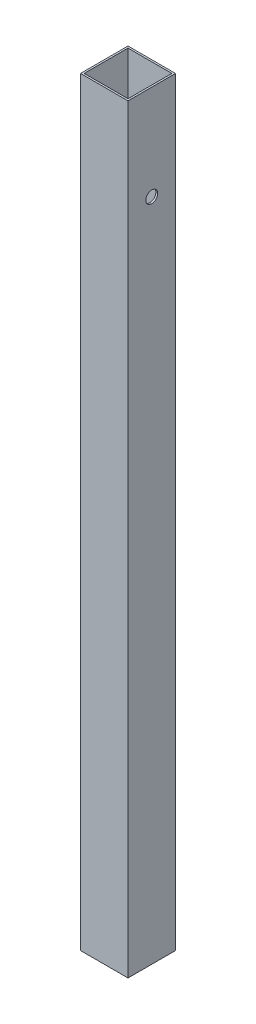
ISO-10303-21;
HEADER;
FILE_DESCRIPTION(('STEP AP214'),'2;1');
FILE_NAME('part.step','',(''),(''),'','','');
FILE_SCHEMA(('AUTOMOTIVE_DESIGN { 1 0 10303 214 1 1 1 1 }'));
ENDSEC;
DATA;
#1=APPLICATION_CONTEXT('core data for automotive mechanical design processes');
#2=APPLICATION_PROTOCOL_DEFINITION('international standard','automotive_design',2000,#1);
#3=PRODUCT_CONTEXT('',#1,'mechanical');
#4=PRODUCT('Part','Part','',(#3));
#5=PRODUCT_RELATED_PRODUCT_CATEGORY('part','',(#4));
#6=PRODUCT_DEFINITION_FORMATION('','',#4);
#7=PRODUCT_DEFINITION_CONTEXT('part definition',#1,'design');
#8=PRODUCT_DEFINITION('design','',#6,#7);
#9=PRODUCT_DEFINITION_SHAPE('','',#8);
#10=(LENGTH_UNIT() NAMED_UNIT(*) SI_UNIT(.MILLI.,.METRE.));
#11=(NAMED_UNIT(*) PLANE_ANGLE_UNIT() SI_UNIT($,.RADIAN.));
#12=(NAMED_UNIT(*) SI_UNIT($,.STERADIAN.) SOLID_ANGLE_UNIT());
#13=UNCERTAINTY_MEASURE_WITH_UNIT(LENGTH_MEASURE(1.E-05),#10,'distance_accuracy_value','');
#14=(GEOMETRIC_REPRESENTATION_CONTEXT(3) GLOBAL_UNCERTAINTY_ASSIGNED_CONTEXT((#13)) GLOBAL_UNIT_ASSIGNED_CONTEXT((#10,
#11,#12)) REPRESENTATION_CONTEXT('',''));
#15=CARTESIAN_POINT('',(0.,0.,0.));
#16=DIRECTION('',(0.,0.,1.));
#17=DIRECTION('',(1.,0.,0.));
#18=AXIS2_PLACEMENT_3D('',#15,#16,#17);
#19=CARTESIAN_POINT('',(0.,406.4,0.));
#20=DIRECTION('',(0.,1.,0.));
#21=DIRECTION('',(0.,0.,1.));
#22=AXIS2_PLACEMENT_3D('',#19,#20,#21);
#23=PLANE('',#22);
#24=DIRECTION('',(0.,0.,-1.));
#25=VECTOR('',#24,1.);
#26=CARTESIAN_POINT('',(12.7,406.4,-12.7));
#27=LINE('',#26,#25);
#28=CARTESIAN_POINT('',(12.7,406.4,12.7));
#29=VERTEX_POINT('',#28);
#30=CARTESIAN_POINT('',(12.7,406.4,-12.7));
#31=VERTEX_POINT('',#30);
#32=EDGE_CURVE('E139',#29,#31,#27,.T.);
#33=ORIENTED_EDGE('',*,*,#32,.T.);
#34=DIRECTION('',(-1.,0.,0.));
#35=VECTOR('',#34,1.);
#36=CARTESIAN_POINT('',(-12.7,406.4,-12.7));
#37=LINE('',#36,#35);
#38=CARTESIAN_POINT('',(-12.7,406.4,-12.7));
#39=VERTEX_POINT('',#38);
#40=EDGE_CURVE('E142',#31,#39,#37,.T.);
#41=ORIENTED_EDGE('',*,*,#40,.T.);
#42=DIRECTION('',(0.,0.,1.));
#43=VECTOR('',#42,1.);
#44=CARTESIAN_POINT('',(-12.7,406.4,-12.7));
#45=LINE('',#44,#43);
#46=CARTESIAN_POINT('',(-12.7,406.4,12.7));
#47=VERTEX_POINT('',#46);
#48=EDGE_CURVE('E145',#39,#47,#45,.T.);
#49=ORIENTED_EDGE('',*,*,#48,.T.);
#50=DIRECTION('',(1.,0.,0.));
#51=VECTOR('',#50,1.);
#52=CARTESIAN_POINT('',(-12.7,406.4,12.7));
#53=LINE('',#52,#51);
#54=EDGE_CURVE('E147',#47,#29,#53,.T.);
#55=ORIENTED_EDGE('',*,*,#54,.T.);
#56=EDGE_LOOP('',(#33,#41,#49,#55));
#57=FACE_BOUND('',#56,.T.);
#58=DIRECTION('',(1.,0.,0.));
#59=VECTOR('',#58,1.);
#60=CARTESIAN_POINT('',(-11.7348,406.4,11.7348));
#61=LINE('',#60,#59);
#62=CARTESIAN_POINT('',(-11.7348,406.4,11.7348));
#63=VERTEX_POINT('',#62);
#64=CARTESIAN_POINT('',(11.7348,406.4,11.7348));
#65=VERTEX_POINT('',#64);
#66=EDGE_CURVE('E109',#63,#65,#61,.T.);
#67=ORIENTED_EDGE('',*,*,#66,.F.);
#68=DIRECTION('',(0.,0.,1.));
#69=VECTOR('',#68,1.);
#70=CARTESIAN_POINT('',(-11.7348,406.4,-11.7348));
#71=LINE('',#70,#69);
#72=CARTESIAN_POINT('',(-11.7348,406.4,-11.7348));
#73=VERTEX_POINT('',#72);
#74=EDGE_CURVE('E101',#73,#63,#71,.T.);
#75=ORIENTED_EDGE('',*,*,#74,.F.);
#76=DIRECTION('',(-1.,0.,0.));
#77=VECTOR('',#76,1.);
#78=CARTESIAN_POINT('',(-11.7348,406.4,-11.7348));
#79=LINE('',#78,#77);
#80=CARTESIAN_POINT('',(11.7348,406.4,-11.7348));
#81=VERTEX_POINT('',#80);
#82=EDGE_CURVE('E123',#81,#73,#79,.T.);
#83=ORIENTED_EDGE('',*,*,#82,.F.);
#84=DIRECTION('',(0.,0.,-1.));
#85=VECTOR('',#84,1.);
#86=CARTESIAN_POINT('',(11.7348,406.4,-11.7348));
#87=LINE('',#86,#85);
#88=EDGE_CURVE('E121',#65,#81,#87,.T.);
#89=ORIENTED_EDGE('',*,*,#88,.F.);
#90=EDGE_LOOP('',(#67,#75,#83,#89));
#91=FACE_BOUND('',#90,.T.);
#92=ADVANCED_FACE('F35',(#57,#91),#23,.T.);
#93=CARTESIAN_POINT('',(0.,0.,0.));
#94=DIRECTION('',(0.,1.,0.));
#95=DIRECTION('',(0.,0.,1.));
#96=AXIS2_PLACEMENT_3D('',#93,#94,#95);
#97=PLANE('',#96);
#98=DIRECTION('',(0.,0.,-1.));
#99=VECTOR('',#98,1.);
#100=CARTESIAN_POINT('',(12.7,0.,-12.7));
#101=LINE('',#100,#99);
#102=CARTESIAN_POINT('',(12.7,0.,12.7));
#103=VERTEX_POINT('',#102);
#104=CARTESIAN_POINT('',(12.7,0.,-12.7));
#105=VERTEX_POINT('',#104);
#106=EDGE_CURVE('E117',#103,#105,#101,.T.);
#107=ORIENTED_EDGE('',*,*,#106,.F.);
#108=DIRECTION('',(1.,0.,0.));
#109=VECTOR('',#108,1.);
#110=CARTESIAN_POINT('',(-12.7,0.,12.7));
#111=LINE('',#110,#109);
#112=CARTESIAN_POINT('',(-12.7,0.,12.7));
#113=VERTEX_POINT('',#112);
#114=EDGE_CURVE('E143',#113,#103,#111,.T.);
#115=ORIENTED_EDGE('',*,*,#114,.F.);
#116=DIRECTION('',(0.,0.,1.));
#117=VECTOR('',#116,1.);
#118=CARTESIAN_POINT('',(-12.7,0.,-12.7));
#119=LINE('',#118,#117);
#120=CARTESIAN_POINT('',(-12.7,0.,-12.7));
#121=VERTEX_POINT('',#120);
#122=EDGE_CURVE('E154',#121,#113,#119,.T.);
#123=ORIENTED_EDGE('',*,*,#122,.F.);
#124=DIRECTION('',(-1.,0.,0.));
#125=VECTOR('',#124,1.);
#126=CARTESIAN_POINT('',(-12.7,0.,-12.7));
#127=LINE('',#126,#125);
#128=EDGE_CURVE('E152',#105,#121,#127,.T.);
#129=ORIENTED_EDGE('',*,*,#128,.F.);
#130=EDGE_LOOP('',(#107,#115,#123,#129));
#131=FACE_BOUND('',#130,.T.);
#132=DIRECTION('',(0.,0.,1.));
#133=VECTOR('',#132,1.);
#134=CARTESIAN_POINT('',(-11.7348,0.,-11.7348));
#135=LINE('',#134,#133);
#136=CARTESIAN_POINT('',(-11.7348,0.,-11.7348));
#137=VERTEX_POINT('',#136);
#138=CARTESIAN_POINT('',(-11.7348,0.,11.7348));
#139=VERTEX_POINT('',#138);
#140=EDGE_CURVE('E59',#137,#139,#135,.T.);
#141=ORIENTED_EDGE('',*,*,#140,.T.);
#142=DIRECTION('',(1.,0.,0.));
#143=VECTOR('',#142,1.);
#144=CARTESIAN_POINT('',(-11.7348,0.,11.7348));
#145=LINE('',#144,#143);
#146=CARTESIAN_POINT('',(11.7348,0.,11.7348));
#147=VERTEX_POINT('',#146);
#148=EDGE_CURVE('E116',#139,#147,#145,.T.);
#149=ORIENTED_EDGE('',*,*,#148,.T.);
#150=DIRECTION('',(0.,0.,-1.));
#151=VECTOR('',#150,1.);
#152=CARTESIAN_POINT('',(11.7348,0.,-11.7348));
#153=LINE('',#152,#151);
#154=CARTESIAN_POINT('',(11.7348,0.,-11.7348));
#155=VERTEX_POINT('',#154);
#156=EDGE_CURVE('E131',#147,#155,#153,.T.);
#157=ORIENTED_EDGE('',*,*,#156,.T.);
#158=DIRECTION('',(-1.,0.,0.));
#159=VECTOR('',#158,1.);
#160=CARTESIAN_POINT('',(-11.7348,0.,-11.7348));
#161=LINE('',#160,#159);
#162=EDGE_CURVE('E110',#155,#137,#161,.T.);
#163=ORIENTED_EDGE('',*,*,#162,.T.);
#164=EDGE_LOOP('',(#141,#149,#157,#163));
#165=FACE_BOUND('',#164,.T.);
#166=ADVANCED_FACE('F173',(#131,#165),#97,.F.);
#167=CARTESIAN_POINT('',(12.7,406.4,-12.7));
#168=DIRECTION('',(-1.,0.,0.));
#169=DIRECTION('',(0.,0.,1.));
#170=AXIS2_PLACEMENT_3D('',#167,#168,#169);
#171=PLANE('',#170);
#172=CARTESIAN_POINT('',(12.7,355.6,0.));
#173=DIRECTION('',(-1.,0.,0.));
#174=DIRECTION('',(0.,0.,1.));
#175=AXIS2_PLACEMENT_3D('',#172,#173,#174);
#176=CIRCLE('',#175,3.175);
#177=CARTESIAN_POINT('',(12.7,355.6,3.175));
#178=VERTEX_POINT('',#177);
#179=EDGE_CURVE('E129',#178,#178,#176,.T.);
#180=ORIENTED_EDGE('',*,*,#179,.T.);
#181=EDGE_LOOP('',(#180));
#182=FACE_BOUND('',#181,.T.);
#183=ORIENTED_EDGE('',*,*,#106,.T.);
#184=DIRECTION('',(0.,-1.,0.));
#185=VECTOR('',#184,1.);
#186=CARTESIAN_POINT('',(12.7,406.4,-12.7));
#187=LINE('',#186,#185);
#188=EDGE_CURVE('E11',#31,#105,#187,.T.);
#189=ORIENTED_EDGE('',*,*,#188,.F.);
#190=ORIENTED_EDGE('',*,*,#32,.F.);
#191=DIRECTION('',(0.,-1.,0.));
#192=VECTOR('',#191,1.);
#193=CARTESIAN_POINT('',(12.7,406.4,12.7));
#194=LINE('',#193,#192);
#195=EDGE_CURVE('E149',#29,#103,#194,.T.);
#196=ORIENTED_EDGE('',*,*,#195,.T.);
#197=EDGE_LOOP('',(#183,#189,#190,#196));
#198=FACE_BOUND('',#197,.T.);
#199=ADVANCED_FACE('F37',(#182,#198),#171,.F.);
#200=CARTESIAN_POINT('',(-12.7,406.4,-12.7));
#201=DIRECTION('',(0.,0.,1.));
#202=DIRECTION('',(1.,0.,0.));
#203=AXIS2_PLACEMENT_3D('',#200,#201,#202);
#204=PLANE('',#203);
#205=ORIENTED_EDGE('',*,*,#128,.T.);
#206=DIRECTION('',(0.,-1.,0.));
#207=VECTOR('',#206,1.);
#208=CARTESIAN_POINT('',(-12.7,406.4,-12.7));
#209=LINE('',#208,#207);
#210=EDGE_CURVE('E44',#39,#121,#209,.T.);
#211=ORIENTED_EDGE('',*,*,#210,.F.);
#212=ORIENTED_EDGE('',*,*,#40,.F.);
#213=ORIENTED_EDGE('',*,*,#188,.T.);
#214=EDGE_LOOP('',(#205,#211,#212,#213));
#215=FACE_BOUND('',#214,.T.);
#216=ADVANCED_FACE('F183',(#215),#204,.F.);
#217=CARTESIAN_POINT('',(-12.7,406.4,-12.7));
#218=DIRECTION('',(1.,0.,0.));
#219=DIRECTION('',(0.,0.,-1.));
#220=AXIS2_PLACEMENT_3D('',#217,#218,#219);
#221=PLANE('',#220);
#222=CARTESIAN_POINT('',(-12.7,355.6,0.));
#223=DIRECTION('',(-1.,0.,0.));
#224=DIRECTION('',(0.,0.,1.));
#225=AXIS2_PLACEMENT_3D('',#222,#223,#224);
#226=CIRCLE('',#225,3.175);
#227=CARTESIAN_POINT('',(-12.7,355.6,3.175));
#228=VERTEX_POINT('',#227);
#229=EDGE_CURVE('E217',#228,#228,#226,.T.);
#230=ORIENTED_EDGE('',*,*,#229,.F.);
#231=EDGE_LOOP('',(#230));
#232=FACE_BOUND('',#231,.T.);
#233=ORIENTED_EDGE('',*,*,#122,.T.);
#234=DIRECTION('',(0.,-1.,0.));
#235=VECTOR('',#234,1.);
#236=CARTESIAN_POINT('',(-12.7,406.4,12.7));
#237=LINE('',#236,#235);
#238=EDGE_CURVE('E159',#47,#113,#237,.T.);
#239=ORIENTED_EDGE('',*,*,#238,.F.);
#240=ORIENTED_EDGE('',*,*,#48,.F.);
#241=ORIENTED_EDGE('',*,*,#210,.T.);
#242=EDGE_LOOP('',(#233,#239,#240,#241));
#243=FACE_BOUND('',#242,.T.);
#244=ADVANCED_FACE('F167',(#232,#243),#221,.F.);
#245=CARTESIAN_POINT('',(-12.7,406.4,12.7));
#246=DIRECTION('',(0.,0.,-1.));
#247=DIRECTION('',(-1.,0.,0.));
#248=AXIS2_PLACEMENT_3D('',#245,#246,#247);
#249=PLANE('',#248);
#250=ORIENTED_EDGE('',*,*,#114,.T.);
#251=ORIENTED_EDGE('',*,*,#195,.F.);
#252=ORIENTED_EDGE('',*,*,#54,.F.);
#253=ORIENTED_EDGE('',*,*,#238,.T.);
#254=EDGE_LOOP('',(#250,#251,#252,#253));
#255=FACE_BOUND('',#254,.T.);
#256=ADVANCED_FACE('F177',(#255),#249,.F.);
#257=CARTESIAN_POINT('',(-11.7348,406.4,-11.7348));
#258=DIRECTION('',(1.,0.,0.));
#259=DIRECTION('',(0.,0.,-1.));
#260=AXIS2_PLACEMENT_3D('',#257,#258,#259);
#261=PLANE('',#260);
#262=CARTESIAN_POINT('',(-11.7348,355.6,0.));
#263=DIRECTION('',(1.,0.,0.));
#264=DIRECTION('',(0.,0.,-1.));
#265=AXIS2_PLACEMENT_3D('',#262,#263,#264);
#266=CIRCLE('',#265,3.175);
#267=CARTESIAN_POINT('',(-11.7348,355.6,-3.175));
#268=VERTEX_POINT('',#267);
#269=EDGE_CURVE('E212',#268,#268,#266,.T.);
#270=ORIENTED_EDGE('',*,*,#269,.F.);
#271=EDGE_LOOP('',(#270));
#272=FACE_BOUND('',#271,.T.);
#273=ORIENTED_EDGE('',*,*,#140,.F.);
#274=DIRECTION('',(0.,-1.,0.));
#275=VECTOR('',#274,1.);
#276=CARTESIAN_POINT('',(-11.7348,406.4,-11.7348));
#277=LINE('',#276,#275);
#278=EDGE_CURVE('E105',#73,#137,#277,.T.);
#279=ORIENTED_EDGE('',*,*,#278,.F.);
#280=ORIENTED_EDGE('',*,*,#74,.T.);
#281=DIRECTION('',(0.,-1.,0.));
#282=VECTOR('',#281,1.);
#283=CARTESIAN_POINT('',(-11.7348,406.4,11.7348));
#284=LINE('',#283,#282);
#285=EDGE_CURVE('E104',#63,#139,#284,.T.);
#286=ORIENTED_EDGE('',*,*,#285,.T.);
#287=EDGE_LOOP('',(#273,#279,#280,#286));
#288=FACE_BOUND('',#287,.T.);
#289=ADVANCED_FACE('F103',(#272,#288),#261,.T.);
#290=CARTESIAN_POINT('',(-11.7348,406.4,11.7348));
#291=DIRECTION('',(0.,0.,-1.));
#292=DIRECTION('',(-1.,0.,0.));
#293=AXIS2_PLACEMENT_3D('',#290,#291,#292);
#294=PLANE('',#293);
#295=ORIENTED_EDGE('',*,*,#148,.F.);
#296=ORIENTED_EDGE('',*,*,#285,.F.);
#297=ORIENTED_EDGE('',*,*,#66,.T.);
#298=DIRECTION('',(0.,-1.,0.));
#299=VECTOR('',#298,1.);
#300=CARTESIAN_POINT('',(11.7348,406.4,11.7348));
#301=LINE('',#300,#299);
#302=EDGE_CURVE('E118',#65,#147,#301,.T.);
#303=ORIENTED_EDGE('',*,*,#302,.T.);
#304=EDGE_LOOP('',(#295,#296,#297,#303));
#305=FACE_BOUND('',#304,.T.);
#306=ADVANCED_FACE('F113',(#305),#294,.T.);
#307=CARTESIAN_POINT('',(11.7348,406.4,-11.7348));
#308=DIRECTION('',(-1.,0.,0.));
#309=DIRECTION('',(0.,0.,1.));
#310=AXIS2_PLACEMENT_3D('',#307,#308,#309);
#311=PLANE('',#310);
#312=CARTESIAN_POINT('',(11.7348,355.6,0.));
#313=DIRECTION('',(-1.,0.,0.));
#314=DIRECTION('',(0.,0.,1.));
#315=AXIS2_PLACEMENT_3D('',#312,#313,#314);
#316=CIRCLE('',#315,3.175);
#317=CARTESIAN_POINT('',(11.7348,355.6,3.175));
#318=VERTEX_POINT('',#317);
#319=EDGE_CURVE('E39',#318,#318,#316,.T.);
#320=ORIENTED_EDGE('',*,*,#319,.F.);
#321=EDGE_LOOP('',(#320));
#322=FACE_BOUND('',#321,.T.);
#323=ORIENTED_EDGE('',*,*,#156,.F.);
#324=ORIENTED_EDGE('',*,*,#302,.F.);
#325=ORIENTED_EDGE('',*,*,#88,.T.);
#326=DIRECTION('',(0.,-1.,0.));
#327=VECTOR('',#326,1.);
#328=CARTESIAN_POINT('',(11.7348,406.4,-11.7348));
#329=LINE('',#328,#327);
#330=EDGE_CURVE('E51',#81,#155,#329,.T.);
#331=ORIENTED_EDGE('',*,*,#330,.T.);
#332=EDGE_LOOP('',(#323,#324,#325,#331));
#333=FACE_BOUND('',#332,.T.);
#334=ADVANCED_FACE('F209',(#322,#333),#311,.T.);
#335=CARTESIAN_POINT('',(-11.7348,406.4,-11.7348));
#336=DIRECTION('',(0.,0.,1.));
#337=DIRECTION('',(1.,0.,0.));
#338=AXIS2_PLACEMENT_3D('',#335,#336,#337);
#339=PLANE('',#338);
#340=ORIENTED_EDGE('',*,*,#162,.F.);
#341=ORIENTED_EDGE('',*,*,#330,.F.);
#342=ORIENTED_EDGE('',*,*,#82,.T.);
#343=ORIENTED_EDGE('',*,*,#278,.T.);
#344=EDGE_LOOP('',(#340,#341,#342,#343));
#345=FACE_BOUND('',#344,.T.);
#346=ADVANCED_FACE('F229',(#345),#339,.T.);
#347=CARTESIAN_POINT('',(393.7,355.6,0.));
#348=DIRECTION('',(-1.,0.,0.));
#349=DIRECTION('',(0.,0.,1.));
#350=AXIS2_PLACEMENT_3D('',#347,#348,#349);
#351=CYLINDRICAL_SURFACE('',#350,3.175);
#352=ORIENTED_EDGE('',*,*,#319,.T.);
#353=EDGE_LOOP('',(#352));
#354=FACE_BOUND('',#353,.T.);
#355=ORIENTED_EDGE('',*,*,#179,.F.);
#356=EDGE_LOOP('',(#355));
#357=FACE_BOUND('',#356,.T.);
#358=ADVANCED_FACE('F224',(#354,#357),#351,.F.);
#359=ORIENTED_EDGE('',*,*,#269,.T.);
#360=EDGE_LOOP('',(#359));
#361=FACE_BOUND('',#360,.T.);
#362=ORIENTED_EDGE('',*,*,#229,.T.);
#363=EDGE_LOOP('',(#362));
#364=FACE_BOUND('',#363,.T.);
#365=ADVANCED_FACE('F222',(#361,#364),#351,.F.);
#366=CLOSED_SHELL('',(#92,#166,#199,#216,#244,#256,#289,#306,#334,#346,#358,#365));
#367=MANIFOLD_SOLID_BREP('B2',#366);
#368=ADVANCED_BREP_SHAPE_REPRESENTATION('',(#18,#367),#14);
#369=SHAPE_DEFINITION_REPRESENTATION(#9,#368);
ENDSEC;
END-ISO-10303-21;
